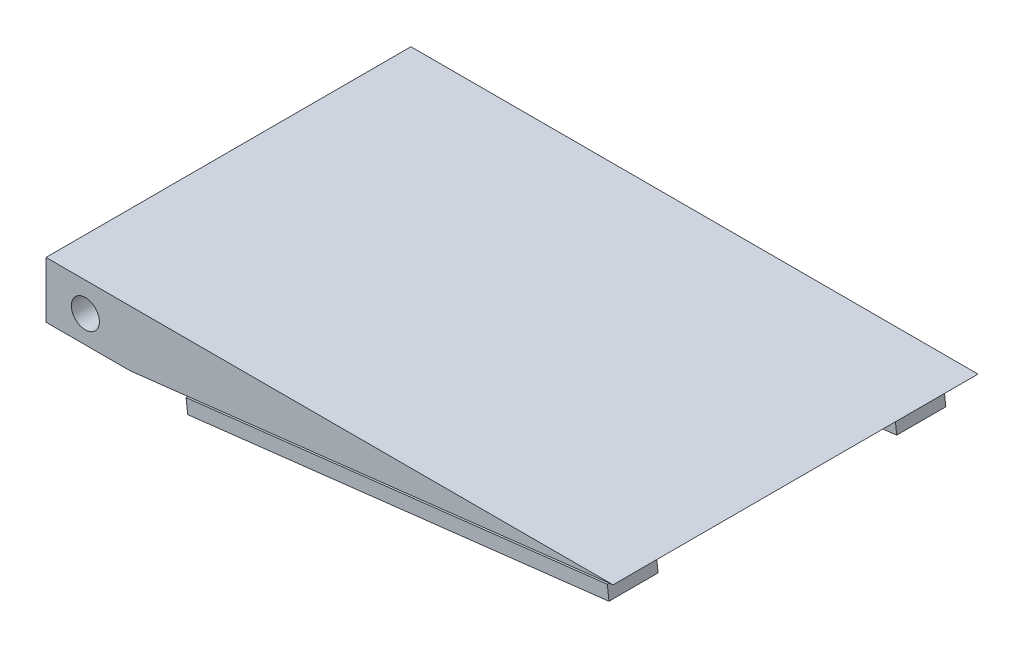
ISO-10303-21;
HEADER;
FILE_DESCRIPTION(('STEP AP214'),'2;1');
FILE_NAME('part.step','',(''),(''),'','','');
FILE_SCHEMA(('AUTOMOTIVE_DESIGN { 1 0 10303 214 1 1 1 1 }'));
ENDSEC;
DATA;
#1=APPLICATION_CONTEXT('core data for automotive mechanical design processes');
#2=APPLICATION_PROTOCOL_DEFINITION('international standard','automotive_design',2000,#1);
#3=PRODUCT_CONTEXT('',#1,'mechanical');
#4=PRODUCT('Part','Part','',(#3));
#5=PRODUCT_RELATED_PRODUCT_CATEGORY('part','',(#4));
#6=PRODUCT_DEFINITION_FORMATION('','',#4);
#7=PRODUCT_DEFINITION_CONTEXT('part definition',#1,'design');
#8=PRODUCT_DEFINITION('design','',#6,#7);
#9=PRODUCT_DEFINITION_SHAPE('','',#8);
#10=(LENGTH_UNIT() NAMED_UNIT(*) SI_UNIT(.MILLI.,.METRE.));
#11=(NAMED_UNIT(*) PLANE_ANGLE_UNIT() SI_UNIT($,.RADIAN.));
#12=(NAMED_UNIT(*) SI_UNIT($,.STERADIAN.) SOLID_ANGLE_UNIT());
#13=UNCERTAINTY_MEASURE_WITH_UNIT(LENGTH_MEASURE(1.E-05),#10,'distance_accuracy_value','');
#14=(GEOMETRIC_REPRESENTATION_CONTEXT(3) GLOBAL_UNCERTAINTY_ASSIGNED_CONTEXT((#13)) GLOBAL_UNIT_ASSIGNED_CONTEXT((#10,
#11,#12)) REPRESENTATION_CONTEXT('',''));
#15=CARTESIAN_POINT('',(0.,0.,0.));
#16=DIRECTION('',(0.,0.,1.));
#17=DIRECTION('',(1.,0.,0.));
#18=AXIS2_PLACEMENT_3D('',#15,#16,#17);
#19=CARTESIAN_POINT('',(-151.627963525836,0.,-166.60547112462));
#20=DIRECTION('',(-0.115500858174564,0.993307380301254,0.));
#21=DIRECTION('',(-0.993307380301254,-0.115500858174564,0.));
#22=AXIS2_PLACEMENT_3D('',#19,#20,#21);
#23=PLANE('',#22);
#24=DIRECTION('',(-0.993307380301254,-0.115500858174564,0.));
#25=VECTOR('',#24,1.);
#26=CARTESIAN_POINT('',(-115.250459170076,4.22994236694888,119.14452887538));
#27=LINE('',#26,#25);
#28=CARTESIAN_POINT('',(265.153546849035,48.4629663226594,119.14452887538));
#29=VERTEX_POINT('',#28);
#30=CARTESIAN_POINT('',(-115.250459170076,4.22994236694888,119.14452887538));
#31=VERTEX_POINT('',#30);
#32=EDGE_CURVE('E236',#29,#31,#27,.T.);
#33=ORIENTED_EDGE('',*,*,#32,.T.);
#34=DIRECTION('',(0.,0.,1.));
#35=VECTOR('',#34,1.);
#36=CARTESIAN_POINT('',(-115.250459170076,4.22994236694888,119.14452887538));
#37=LINE('',#36,#35);
#38=CARTESIAN_POINT('',(-115.250459170076,4.22994236694888,138.19452887538));
#39=VERTEX_POINT('',#38);
#40=EDGE_CURVE('E190',#31,#39,#37,.T.);
#41=ORIENTED_EDGE('',*,*,#40,.T.);
#42=DIRECTION('',(0.993307380301254,0.115500858174564,0.));
#43=VECTOR('',#42,1.);
#44=CARTESIAN_POINT('',(-115.250459170076,4.22994236694888,138.19452887538));
#45=LINE('',#44,#43);
#46=CARTESIAN_POINT('',(265.153546849035,48.4629663226594,138.19452887538));
#47=VERTEX_POINT('',#46);
#48=EDGE_CURVE('E227',#39,#47,#45,.T.);
#49=ORIENTED_EDGE('',*,*,#48,.T.);
#50=DIRECTION('',(0.,0.,-1.));
#51=VECTOR('',#50,1.);
#52=CARTESIAN_POINT('',(265.153546849035,48.4629663226594,119.14452887538));
#53=LINE('',#52,#51);
#54=EDGE_CURVE('E54',#47,#29,#53,.T.);
#55=ORIENTED_EDGE('',*,*,#54,.T.);
#56=EDGE_LOOP('',(#33,#41,#49,#55));
#57=FACE_BOUND('',#56,.T.);
#58=DIRECTION('',(-0.993307380301254,-0.115500858174564,0.));
#59=VECTOR('',#58,1.);
#60=CARTESIAN_POINT('',(-151.627963525836,0.,163.59452887538));
#61=LINE('',#60,#59);
#62=CARTESIAN_POINT('',(285.252036474164,50.8,163.59452887538));
#63=VERTEX_POINT('',#62);
#64=CARTESIAN_POINT('',(-151.627963525836,0.,163.59452887538));
#65=VERTEX_POINT('',#64);
#66=EDGE_CURVE('E315',#63,#65,#61,.T.);
#67=ORIENTED_EDGE('',*,*,#66,.T.);
#68=DIRECTION('',(0.,0.,1.));
#69=VECTOR('',#68,1.);
#70=CARTESIAN_POINT('',(-151.627963525836,0.,-166.60547112462));
#71=LINE('',#70,#69);
#72=CARTESIAN_POINT('',(-151.627963525836,0.,-166.60547112462));
#73=VERTEX_POINT('',#72);
#74=EDGE_CURVE('E314',#73,#65,#71,.T.);
#75=ORIENTED_EDGE('',*,*,#74,.F.);
#76=DIRECTION('',(-0.993307380301254,-0.115500858174564,0.));
#77=VECTOR('',#76,1.);
#78=CARTESIAN_POINT('',(-151.627963525836,0.,-166.60547112462));
#79=LINE('',#78,#77);
#80=CARTESIAN_POINT('',(285.252036474164,50.8,-166.60547112462));
#81=VERTEX_POINT('',#80);
#82=EDGE_CURVE('E311',#81,#73,#79,.T.);
#83=ORIENTED_EDGE('',*,*,#82,.F.);
#84=DIRECTION('',(0.,0.,-1.));
#85=VECTOR('',#84,1.);
#86=CARTESIAN_POINT('',(285.252036474164,50.8,-166.60547112462));
#87=LINE('',#86,#85);
#88=EDGE_CURVE('E332',#63,#81,#87,.T.);
#89=ORIENTED_EDGE('',*,*,#88,.F.);
#90=EDGE_LOOP('',(#67,#75,#83,#89));
#91=FACE_BOUND('',#90,.T.);
#92=DIRECTION('',(0.,0.,-1.));
#93=VECTOR('',#92,1.);
#94=CARTESIAN_POINT('',(-115.250459170076,4.22994236694888,-122.15547112462));
#95=LINE('',#94,#93);
#96=CARTESIAN_POINT('',(-115.250459170076,4.22994236694888,-122.15547112462));
#97=VERTEX_POINT('',#96);
#98=CARTESIAN_POINT('',(-115.250459170076,4.22994236694888,-141.20547112462));
#99=VERTEX_POINT('',#98);
#100=EDGE_CURVE('E280',#97,#99,#95,.T.);
#101=ORIENTED_EDGE('',*,*,#100,.F.);
#102=DIRECTION('',(-0.993307380301254,-0.115500858174564,0.));
#103=VECTOR('',#102,1.);
#104=CARTESIAN_POINT('',(-115.250459170076,4.22994236694888,-122.15547112462));
#105=LINE('',#104,#103);
#106=CARTESIAN_POINT('',(265.153546849035,48.4629663226594,-122.15547112462));
#107=VERTEX_POINT('',#106);
#108=EDGE_CURVE('E285',#107,#97,#105,.T.);
#109=ORIENTED_EDGE('',*,*,#108,.F.);
#110=DIRECTION('',(0.,0.,1.));
#111=VECTOR('',#110,1.);
#112=CARTESIAN_POINT('',(265.153546849035,48.4629663226594,-122.15547112462));
#113=LINE('',#112,#111);
#114=CARTESIAN_POINT('',(265.153546849035,48.4629663226594,-141.20547112462));
#115=VERTEX_POINT('',#114);
#116=EDGE_CURVE('E295',#115,#107,#113,.T.);
#117=ORIENTED_EDGE('',*,*,#116,.F.);
#118=DIRECTION('',(0.993307380301254,0.115500858174564,0.));
#119=VECTOR('',#118,1.);
#120=CARTESIAN_POINT('',(-115.250459170076,4.22994236694888,-141.20547112462));
#121=LINE('',#120,#119);
#122=EDGE_CURVE('E62',#99,#115,#121,.T.);
#123=ORIENTED_EDGE('',*,*,#122,.F.);
#124=EDGE_LOOP('',(#101,#109,#117,#123));
#125=FACE_BOUND('',#124,.T.);
#126=ADVANCED_FACE('F39',(#57,#91,#125),#23,.F.);
#127=CARTESIAN_POINT('',(-227.827963525836,50.8,-166.60547112462));
#128=DIRECTION('',(1.,0.,0.));
#129=DIRECTION('',(0.,0.,-1.));
#130=AXIS2_PLACEMENT_3D('',#127,#128,#129);
#131=PLANE('',#130);
#132=DIRECTION('',(0.,0.,1.));
#133=VECTOR('',#132,1.);
#134=CARTESIAN_POINT('',(-227.827963525836,0.,-166.60547112462));
#135=LINE('',#134,#133);
#136=CARTESIAN_POINT('',(-227.827963525836,0.,-166.60547112462));
#137=VERTEX_POINT('',#136);
#138=CARTESIAN_POINT('',(-227.827963525836,0.,163.59452887538));
#139=VERTEX_POINT('',#138);
#140=EDGE_CURVE('E320',#137,#139,#135,.T.);
#141=ORIENTED_EDGE('',*,*,#140,.T.);
#142=DIRECTION('',(0.,-1.,0.));
#143=VECTOR('',#142,1.);
#144=CARTESIAN_POINT('',(-227.827963525836,50.8,163.59452887538));
#145=LINE('',#144,#143);
#146=CARTESIAN_POINT('',(-227.827963525836,50.8,163.59452887538));
#147=VERTEX_POINT('',#146);
#148=EDGE_CURVE('E11',#147,#139,#145,.T.);
#149=ORIENTED_EDGE('',*,*,#148,.F.);
#150=DIRECTION('',(0.,0.,1.));
#151=VECTOR('',#150,1.);
#152=CARTESIAN_POINT('',(-227.827963525836,50.8,-166.60547112462));
#153=LINE('',#152,#151);
#154=CARTESIAN_POINT('',(-227.827963525836,50.8,-166.60547112462));
#155=VERTEX_POINT('',#154);
#156=EDGE_CURVE('E325',#155,#147,#153,.T.);
#157=ORIENTED_EDGE('',*,*,#156,.F.);
#158=DIRECTION('',(0.,-1.,0.));
#159=VECTOR('',#158,1.);
#160=CARTESIAN_POINT('',(-227.827963525836,50.8,-166.60547112462));
#161=LINE('',#160,#159);
#162=EDGE_CURVE('E47',#155,#137,#161,.T.);
#163=ORIENTED_EDGE('',*,*,#162,.T.);
#164=EDGE_LOOP('',(#141,#149,#157,#163));
#165=FACE_BOUND('',#164,.T.);
#166=ADVANCED_FACE('F41',(#165),#131,.F.);
#167=CARTESIAN_POINT('',(-227.827963525836,50.8,163.59452887538));
#168=DIRECTION('',(0.,0.,-1.));
#169=DIRECTION('',(-1.,0.,0.));
#170=AXIS2_PLACEMENT_3D('',#167,#168,#169);
#171=PLANE('',#170);
#172=CARTESIAN_POINT('',(-192.209486061846,24.513920690372,163.59452887538));
#173=DIRECTION('',(0.,0.,1.));
#174=DIRECTION('',(1.,0.,0.));
#175=AXIS2_PLACEMENT_3D('',#172,#173,#174);
#176=CIRCLE('',#175,12.7);
#177=CARTESIAN_POINT('',(-179.509486061846,24.513920690372,163.59452887538));
#178=VERTEX_POINT('',#177);
#179=EDGE_CURVE('E317',#178,#178,#176,.T.);
#180=ORIENTED_EDGE('',*,*,#179,.F.);
#181=EDGE_LOOP('',(#180));
#182=FACE_BOUND('',#181,.T.);
#183=DIRECTION('',(1.,0.,0.));
#184=VECTOR('',#183,1.);
#185=CARTESIAN_POINT('',(-227.827963525836,0.,163.59452887538));
#186=LINE('',#185,#184);
#187=EDGE_CURVE('E339',#139,#65,#186,.T.);
#188=ORIENTED_EDGE('',*,*,#187,.T.);
#189=ORIENTED_EDGE('',*,*,#66,.F.);
#190=DIRECTION('',(1.,0.,0.));
#191=VECTOR('',#190,1.);
#192=CARTESIAN_POINT('',(-227.827963525836,50.8,163.59452887538));
#193=LINE('',#192,#191);
#194=EDGE_CURVE('E328',#147,#63,#193,.T.);
#195=ORIENTED_EDGE('',*,*,#194,.F.);
#196=ORIENTED_EDGE('',*,*,#148,.T.);
#197=EDGE_LOOP('',(#188,#189,#195,#196));
#198=FACE_BOUND('',#197,.T.);
#199=ADVANCED_FACE('F355',(#182,#198),#171,.F.);
#200=CARTESIAN_POINT('',(-227.827963525836,50.8,-166.60547112462));
#201=DIRECTION('',(0.,0.,1.));
#202=DIRECTION('',(1.,0.,0.));
#203=AXIS2_PLACEMENT_3D('',#200,#201,#202);
#204=PLANE('',#203);
#205=CARTESIAN_POINT('',(-192.209486061846,24.513920690372,-166.60547112462));
#206=DIRECTION('',(0.,0.,1.));
#207=DIRECTION('',(1.,0.,0.));
#208=AXIS2_PLACEMENT_3D('',#205,#206,#207);
#209=CIRCLE('',#208,12.7);
#210=CARTESIAN_POINT('',(-179.509486061846,24.513920690372,-166.60547112462));
#211=VERTEX_POINT('',#210);
#212=EDGE_CURVE('E310',#211,#211,#209,.T.);
#213=ORIENTED_EDGE('',*,*,#212,.T.);
#214=EDGE_LOOP('',(#213));
#215=FACE_BOUND('',#214,.T.);
#216=DIRECTION('',(-1.,0.,0.));
#217=VECTOR('',#216,1.);
#218=CARTESIAN_POINT('',(-227.827963525836,50.8,-166.60547112462));
#219=LINE('',#218,#217);
#220=EDGE_CURVE('E335',#81,#155,#219,.T.);
#221=ORIENTED_EDGE('',*,*,#220,.F.);
#222=ORIENTED_EDGE('',*,*,#82,.T.);
#223=DIRECTION('',(-1.,0.,0.));
#224=VECTOR('',#223,1.);
#225=CARTESIAN_POINT('',(-227.827963525836,0.,-166.60547112462));
#226=LINE('',#225,#224);
#227=EDGE_CURVE('E329',#73,#137,#226,.T.);
#228=ORIENTED_EDGE('',*,*,#227,.T.);
#229=ORIENTED_EDGE('',*,*,#162,.F.);
#230=EDGE_LOOP('',(#221,#222,#228,#229));
#231=FACE_BOUND('',#230,.T.);
#232=ADVANCED_FACE('F358',(#215,#231),#204,.F.);
#233=CARTESIAN_POINT('',(0.,50.8,0.));
#234=DIRECTION('',(0.,1.,0.));
#235=DIRECTION('',(0.,0.,1.));
#236=AXIS2_PLACEMENT_3D('',#233,#234,#235);
#237=PLANE('',#236);
#238=ORIENTED_EDGE('',*,*,#156,.T.);
#239=ORIENTED_EDGE('',*,*,#194,.T.);
#240=ORIENTED_EDGE('',*,*,#88,.T.);
#241=ORIENTED_EDGE('',*,*,#220,.T.);
#242=EDGE_LOOP('',(#238,#239,#240,#241));
#243=FACE_BOUND('',#242,.T.);
#244=ADVANCED_FACE('F357',(#243),#237,.T.);
#245=CARTESIAN_POINT('',(0.,0.,0.));
#246=DIRECTION('',(0.,1.,0.));
#247=DIRECTION('',(0.,0.,1.));
#248=AXIS2_PLACEMENT_3D('',#245,#246,#247);
#249=PLANE('',#248);
#250=ORIENTED_EDGE('',*,*,#227,.F.);
#251=ORIENTED_EDGE('',*,*,#74,.T.);
#252=ORIENTED_EDGE('',*,*,#187,.F.);
#253=ORIENTED_EDGE('',*,*,#140,.F.);
#254=EDGE_LOOP('',(#250,#251,#252,#253));
#255=FACE_BOUND('',#254,.T.);
#256=ADVANCED_FACE('F352',(#255),#249,.F.);
#257=CARTESIAN_POINT('',(-192.209486061846,24.513920690372,-166.60547112462));
#258=DIRECTION('',(0.,0.,1.));
#259=DIRECTION('',(1.,0.,0.));
#260=AXIS2_PLACEMENT_3D('',#257,#258,#259);
#261=CYLINDRICAL_SURFACE('',#260,12.7);
#262=ORIENTED_EDGE('',*,*,#212,.F.);
#263=EDGE_LOOP('',(#262));
#264=FACE_BOUND('',#263,.T.);
#265=ORIENTED_EDGE('',*,*,#179,.T.);
#266=EDGE_LOOP('',(#265));
#267=FACE_BOUND('',#266,.T.);
#268=ADVANCED_FACE('F413',(#264,#267),#261,.F.);
#269=CARTESIAN_POINT('',(-113.783598271259,-8.38506136287704,-122.15547112462));
#270=DIRECTION('',(0.993307380301254,0.115500858174564,0.));
#271=DIRECTION('',(-0.115500858174564,0.993307380301254,0.));
#272=AXIS2_PLACEMENT_3D('',#269,#270,#271);
#273=PLANE('',#272);
#274=ORIENTED_EDGE('',*,*,#100,.T.);
#275=DIRECTION('',(-0.115500858174564,0.993307380301254,0.));
#276=VECTOR('',#275,1.);
#277=CARTESIAN_POINT('',(-113.783598271259,-8.38506136287704,-141.20547112462));
#278=LINE('',#277,#276);
#279=CARTESIAN_POINT('',(-113.783598271259,-8.38506136287703,-141.20547112462));
#280=VERTEX_POINT('',#279);
#281=EDGE_CURVE('E308',#280,#99,#278,.T.);
#282=ORIENTED_EDGE('',*,*,#281,.F.);
#283=DIRECTION('',(0.,0.,-1.));
#284=VECTOR('',#283,1.);
#285=CARTESIAN_POINT('',(-113.783598271259,-8.38506136287703,-109.45547112462));
#286=LINE('',#285,#284);
#287=CARTESIAN_POINT('',(-113.783598271259,-8.38506136287703,-153.90547112462));
#288=VERTEX_POINT('',#287);
#289=EDGE_CURVE('E249',#280,#288,#286,.T.);
#290=ORIENTED_EDGE('',*,*,#289,.T.);
#291=DIRECTION('',(-0.115500858174564,0.993307380301254,0.));
#292=VECTOR('',#291,1.);
#293=CARTESIAN_POINT('',(-112.316737372442,-21.000065092703,-153.90547112462));
#294=LINE('',#293,#292);
#295=CARTESIAN_POINT('',(-112.316737372442,-21.000065092703,-153.90547112462));
#296=VERTEX_POINT('',#295);
#297=EDGE_CURVE('E277',#296,#288,#294,.T.);
#298=ORIENTED_EDGE('',*,*,#297,.F.);
#299=DIRECTION('',(0.,0.,-1.));
#300=VECTOR('',#299,1.);
#301=CARTESIAN_POINT('',(-112.316737372442,-21.000065092703,-109.45547112462));
#302=LINE('',#301,#300);
#303=CARTESIAN_POINT('',(-112.316737372442,-21.000065092703,-109.45547112462));
#304=VERTEX_POINT('',#303);
#305=EDGE_CURVE('E250',#304,#296,#302,.T.);
#306=ORIENTED_EDGE('',*,*,#305,.F.);
#307=DIRECTION('',(-0.115500858174564,0.993307380301254,0.));
#308=VECTOR('',#307,1.);
#309=CARTESIAN_POINT('',(-112.316737372442,-21.000065092703,-109.45547112462));
#310=LINE('',#309,#308);
#311=CARTESIAN_POINT('',(-113.783598271259,-8.38506136287703,-109.45547112462));
#312=VERTEX_POINT('',#311);
#313=EDGE_CURVE('E260',#304,#312,#310,.T.);
#314=ORIENTED_EDGE('',*,*,#313,.T.);
#315=CARTESIAN_POINT('',(-113.783598271259,-8.38506136287704,-122.15547112462));
#316=VERTEX_POINT('',#315);
#317=EDGE_CURVE('E261',#312,#316,#286,.T.);
#318=ORIENTED_EDGE('',*,*,#317,.T.);
#319=DIRECTION('',(-0.115500858174564,0.993307380301254,0.));
#320=VECTOR('',#319,1.);
#321=CARTESIAN_POINT('',(-113.783598271259,-8.38506136287704,-122.15547112462));
#322=LINE('',#321,#320);
#323=EDGE_CURVE('E291',#316,#97,#322,.T.);
#324=ORIENTED_EDGE('',*,*,#323,.T.);
#325=EDGE_LOOP('',(#274,#282,#290,#298,#306,#314,#318,#324));
#326=FACE_BOUND('',#325,.T.);
#327=ADVANCED_FACE('F367',(#326),#273,.F.);
#328=CARTESIAN_POINT('',(-113.783598271259,-8.38506136287704,-141.20547112462));
#329=DIRECTION('',(0.,0.,1.));
#330=DIRECTION('',(1.,0.,0.));
#331=AXIS2_PLACEMENT_3D('',#328,#329,#330);
#332=PLANE('',#331);
#333=ORIENTED_EDGE('',*,*,#122,.T.);
#334=DIRECTION('',(-0.115500858174564,0.993307380301254,0.));
#335=VECTOR('',#334,1.);
#336=CARTESIAN_POINT('',(266.620407747852,35.8479625928335,-141.20547112462));
#337=LINE('',#336,#335);
#338=CARTESIAN_POINT('',(266.620407747852,35.8479625928335,-141.20547112462));
#339=VERTEX_POINT('',#338);
#340=EDGE_CURVE('E305',#339,#115,#337,.T.);
#341=ORIENTED_EDGE('',*,*,#340,.F.);
#342=DIRECTION('',(0.993307380301254,0.115500858174564,0.));
#343=VECTOR('',#342,1.);
#344=CARTESIAN_POINT('',(-113.783598271259,-8.38506136287704,-141.20547112462));
#345=LINE('',#344,#343);
#346=EDGE_CURVE('E281',#280,#339,#345,.T.);
#347=ORIENTED_EDGE('',*,*,#346,.F.);
#348=ORIENTED_EDGE('',*,*,#281,.T.);
#349=EDGE_LOOP('',(#333,#341,#347,#348));
#350=FACE_BOUND('',#349,.T.);
#351=ADVANCED_FACE('F381',(#350),#332,.F.);
#352=CARTESIAN_POINT('',(266.620407747852,35.8479625928335,-122.15547112462));
#353=DIRECTION('',(-0.993307380301254,-0.115500858174564,0.));
#354=DIRECTION('',(0.115500858174564,-0.993307380301254,0.));
#355=AXIS2_PLACEMENT_3D('',#352,#353,#354);
#356=PLANE('',#355);
#357=ORIENTED_EDGE('',*,*,#116,.T.);
#358=DIRECTION('',(-0.115500858174564,0.993307380301254,0.));
#359=VECTOR('',#358,1.);
#360=CARTESIAN_POINT('',(266.620407747852,35.8479625928335,-122.15547112462));
#361=LINE('',#360,#359);
#362=CARTESIAN_POINT('',(266.620407747852,35.8479625928335,-122.15547112462));
#363=VERTEX_POINT('',#362);
#364=EDGE_CURVE('E302',#363,#107,#361,.T.);
#365=ORIENTED_EDGE('',*,*,#364,.F.);
#366=DIRECTION('',(0.,0.,1.));
#367=VECTOR('',#366,1.);
#368=CARTESIAN_POINT('',(266.620407747852,35.8479625928335,-122.15547112462));
#369=LINE('',#368,#367);
#370=EDGE_CURVE('E284',#339,#363,#369,.T.);
#371=ORIENTED_EDGE('',*,*,#370,.F.);
#372=ORIENTED_EDGE('',*,*,#340,.T.);
#373=EDGE_LOOP('',(#357,#365,#371,#372));
#374=FACE_BOUND('',#373,.T.);
#375=ADVANCED_FACE('F379',(#374),#356,.F.);
#376=CARTESIAN_POINT('',(-113.783598271259,-8.38506136287704,-122.15547112462));
#377=DIRECTION('',(0.,0.,-1.));
#378=DIRECTION('',(-1.,0.,0.));
#379=AXIS2_PLACEMENT_3D('',#376,#377,#378);
#380=PLANE('',#379);
#381=ORIENTED_EDGE('',*,*,#108,.T.);
#382=ORIENTED_EDGE('',*,*,#323,.F.);
#383=DIRECTION('',(-0.993307380301254,-0.115500858174564,0.));
#384=VECTOR('',#383,1.);
#385=CARTESIAN_POINT('',(-113.783598271259,-8.38506136287704,-122.15547112462));
#386=LINE('',#385,#384);
#387=EDGE_CURVE('E288',#363,#316,#386,.T.);
#388=ORIENTED_EDGE('',*,*,#387,.F.);
#389=ORIENTED_EDGE('',*,*,#364,.T.);
#390=EDGE_LOOP('',(#381,#382,#388,#389));
#391=FACE_BOUND('',#390,.T.);
#392=ADVANCED_FACE('F365',(#391),#380,.F.);
#393=CARTESIAN_POINT('',(-0.555924100193652,4.7809472616654,0.));
#394=DIRECTION('',(0.115500858174564,-0.993307380301254,0.));
#395=DIRECTION('',(0.993307380301254,0.115500858174564,0.));
#396=AXIS2_PLACEMENT_3D('',#393,#394,#395);
#397=PLANE('',#396);
#398=ORIENTED_EDGE('',*,*,#289,.F.);
#399=ORIENTED_EDGE('',*,*,#346,.T.);
#400=ORIENTED_EDGE('',*,*,#370,.T.);
#401=ORIENTED_EDGE('',*,*,#387,.T.);
#402=ORIENTED_EDGE('',*,*,#317,.F.);
#403=DIRECTION('',(-0.993307380301254,-0.115500858174564,0.));
#404=VECTOR('',#403,1.);
#405=CARTESIAN_POINT('',(-113.783598271259,-8.38506136287703,-109.45547112462));
#406=LINE('',#405,#404);
#407=CARTESIAN_POINT('',(267.370318197885,35.9351614823723,-109.45547112462));
#408=VERTEX_POINT('',#407);
#409=EDGE_CURVE('E254',#408,#312,#406,.T.);
#410=ORIENTED_EDGE('',*,*,#409,.F.);
#411=DIRECTION('',(0.,0.,1.));
#412=VECTOR('',#411,1.);
#413=CARTESIAN_POINT('',(267.370318197885,35.9351614823723,-109.45547112462));
#414=LINE('',#413,#412);
#415=CARTESIAN_POINT('',(267.370318197885,35.9351614823723,-153.90547112462));
#416=VERTEX_POINT('',#415);
#417=EDGE_CURVE('E266',#416,#408,#414,.T.);
#418=ORIENTED_EDGE('',*,*,#417,.F.);
#419=DIRECTION('',(0.993307380301254,0.115500858174564,0.));
#420=VECTOR('',#419,1.);
#421=CARTESIAN_POINT('',(-113.783598271259,-8.38506136287703,-153.90547112462));
#422=LINE('',#421,#420);
#423=EDGE_CURVE('E264',#288,#416,#422,.T.);
#424=ORIENTED_EDGE('',*,*,#423,.F.);
#425=EDGE_LOOP('',(#398,#399,#400,#401,#402,#410,#418,#424));
#426=FACE_BOUND('',#425,.T.);
#427=ADVANCED_FACE('F374',(#426),#397,.F.);
#428=CARTESIAN_POINT('',(-112.316737372442,-21.000065092703,-153.90547112462));
#429=DIRECTION('',(0.,0.,1.));
#430=DIRECTION('',(1.,0.,0.));
#431=AXIS2_PLACEMENT_3D('',#428,#429,#430);
#432=PLANE('',#431);
#433=ORIENTED_EDGE('',*,*,#423,.T.);
#434=DIRECTION('',(-0.115500858174564,0.993307380301254,0.));
#435=VECTOR('',#434,1.);
#436=CARTESIAN_POINT('',(268.837179096702,23.3201577525464,-153.90547112462));
#437=LINE('',#436,#435);
#438=CARTESIAN_POINT('',(268.837179096702,23.3201577525464,-153.90547112462));
#439=VERTEX_POINT('',#438);
#440=EDGE_CURVE('E274',#439,#416,#437,.T.);
#441=ORIENTED_EDGE('',*,*,#440,.F.);
#442=DIRECTION('',(0.993307380301254,0.115500858174564,0.));
#443=VECTOR('',#442,1.);
#444=CARTESIAN_POINT('',(-112.316737372442,-21.000065092703,-153.90547112462));
#445=LINE('',#444,#443);
#446=EDGE_CURVE('E253',#296,#439,#445,.T.);
#447=ORIENTED_EDGE('',*,*,#446,.F.);
#448=ORIENTED_EDGE('',*,*,#297,.T.);
#449=EDGE_LOOP('',(#433,#441,#447,#448));
#450=FACE_BOUND('',#449,.T.);
#451=ADVANCED_FACE('F386',(#450),#432,.F.);
#452=CARTESIAN_POINT('',(268.837179096702,23.3201577525464,-109.45547112462));
#453=DIRECTION('',(-0.993307380301254,-0.115500858174564,0.));
#454=DIRECTION('',(0.115500858174564,-0.993307380301254,0.));
#455=AXIS2_PLACEMENT_3D('',#452,#453,#454);
#456=PLANE('',#455);
#457=ORIENTED_EDGE('',*,*,#417,.T.);
#458=DIRECTION('',(-0.115500858174564,0.993307380301254,0.));
#459=VECTOR('',#458,1.);
#460=CARTESIAN_POINT('',(268.837179096702,23.3201577525464,-109.45547112462));
#461=LINE('',#460,#459);
#462=CARTESIAN_POINT('',(268.837179096702,23.3201577525464,-109.45547112462));
#463=VERTEX_POINT('',#462);
#464=EDGE_CURVE('E271',#463,#408,#461,.T.);
#465=ORIENTED_EDGE('',*,*,#464,.F.);
#466=DIRECTION('',(0.,0.,1.));
#467=VECTOR('',#466,1.);
#468=CARTESIAN_POINT('',(268.837179096702,23.3201577525464,-109.45547112462));
#469=LINE('',#468,#467);
#470=EDGE_CURVE('E256',#439,#463,#469,.T.);
#471=ORIENTED_EDGE('',*,*,#470,.F.);
#472=ORIENTED_EDGE('',*,*,#440,.T.);
#473=EDGE_LOOP('',(#457,#465,#471,#472));
#474=FACE_BOUND('',#473,.T.);
#475=ADVANCED_FACE('F395',(#474),#456,.F.);
#476=CARTESIAN_POINT('',(-112.316737372442,-21.000065092703,-109.45547112462));
#477=DIRECTION('',(0.,0.,-1.));
#478=DIRECTION('',(-1.,0.,0.));
#479=AXIS2_PLACEMENT_3D('',#476,#477,#478);
#480=PLANE('',#479);
#481=ORIENTED_EDGE('',*,*,#409,.T.);
#482=ORIENTED_EDGE('',*,*,#313,.F.);
#483=DIRECTION('',(-0.993307380301254,-0.115500858174564,0.));
#484=VECTOR('',#483,1.);
#485=CARTESIAN_POINT('',(-112.316737372442,-21.000065092703,-109.45547112462));
#486=LINE('',#485,#484);
#487=EDGE_CURVE('E258',#463,#304,#486,.T.);
#488=ORIENTED_EDGE('',*,*,#487,.F.);
#489=ORIENTED_EDGE('',*,*,#464,.T.);
#490=EDGE_LOOP('',(#481,#482,#488,#489));
#491=FACE_BOUND('',#490,.T.);
#492=ADVANCED_FACE('F393',(#491),#480,.F.);
#493=CARTESIAN_POINT('',(0.910936798623316,-7.83405646816052,0.));
#494=DIRECTION('',(0.115500858174564,-0.993307380301254,0.));
#495=DIRECTION('',(0.993307380301254,0.115500858174564,0.));
#496=AXIS2_PLACEMENT_3D('',#493,#494,#495);
#497=PLANE('',#496);
#498=ORIENTED_EDGE('',*,*,#305,.T.);
#499=ORIENTED_EDGE('',*,*,#446,.T.);
#500=ORIENTED_EDGE('',*,*,#470,.T.);
#501=ORIENTED_EDGE('',*,*,#487,.T.);
#502=EDGE_LOOP('',(#498,#499,#500,#501));
#503=FACE_BOUND('',#502,.T.);
#504=ADVANCED_FACE('F389',(#503),#497,.T.);
#505=CARTESIAN_POINT('',(-113.783598271259,-8.38506136287704,119.14452887538));
#506=DIRECTION('',(-0.993307380301254,-0.115500858174564,0.));
#507=DIRECTION('',(0.115500858174564,-0.993307380301254,0.));
#508=AXIS2_PLACEMENT_3D('',#505,#506,#507);
#509=PLANE('',#508);
#510=ORIENTED_EDGE('',*,*,#40,.F.);
#511=DIRECTION('',(-0.115500858174564,0.993307380301254,0.));
#512=VECTOR('',#511,1.);
#513=CARTESIAN_POINT('',(-113.783598271259,-8.38506136287704,119.14452887538));
#514=LINE('',#513,#512);
#515=CARTESIAN_POINT('',(-113.783598271259,-8.38506136287703,119.14452887538));
#516=VERTEX_POINT('',#515);
#517=EDGE_CURVE('E247',#516,#31,#514,.T.);
#518=ORIENTED_EDGE('',*,*,#517,.F.);
#519=DIRECTION('',(0.,0.,1.));
#520=VECTOR('',#519,1.);
#521=CARTESIAN_POINT('',(-113.783598271259,-8.38506136287703,106.44452887538));
#522=LINE('',#521,#520);
#523=CARTESIAN_POINT('',(-113.783598271259,-8.38506136287703,106.44452887538));
#524=VERTEX_POINT('',#523);
#525=EDGE_CURVE('E185',#524,#516,#522,.T.);
#526=ORIENTED_EDGE('',*,*,#525,.F.);
#527=DIRECTION('',(-0.115500858174564,0.993307380301254,0.));
#528=VECTOR('',#527,1.);
#529=CARTESIAN_POINT('',(-112.316737372442,-21.000065092703,106.44452887538));
#530=LINE('',#529,#528);
#531=CARTESIAN_POINT('',(-112.316737372442,-21.000065092703,106.44452887538));
#532=VERTEX_POINT('',#531);
#533=EDGE_CURVE('E177',#532,#524,#530,.T.);
#534=ORIENTED_EDGE('',*,*,#533,.F.);
#535=DIRECTION('',(0.,0.,1.));
#536=VECTOR('',#535,1.);
#537=CARTESIAN_POINT('',(-112.316737372442,-21.000065092703,106.44452887538));
#538=LINE('',#537,#536);
#539=CARTESIAN_POINT('',(-112.316737372442,-21.000065092703,150.89452887538));
#540=VERTEX_POINT('',#539);
#541=EDGE_CURVE('E182',#532,#540,#538,.T.);
#542=ORIENTED_EDGE('',*,*,#541,.T.);
#543=DIRECTION('',(-0.115500858174564,0.993307380301254,0.));
#544=VECTOR('',#543,1.);
#545=CARTESIAN_POINT('',(-112.316737372442,-21.000065092703,150.89452887538));
#546=LINE('',#545,#544);
#547=CARTESIAN_POINT('',(-113.783598271259,-8.38506136287703,150.89452887538));
#548=VERTEX_POINT('',#547);
#549=EDGE_CURVE('E209',#540,#548,#546,.T.);
#550=ORIENTED_EDGE('',*,*,#549,.T.);
#551=CARTESIAN_POINT('',(-113.783598271259,-8.38506136287704,138.19452887538));
#552=VERTEX_POINT('',#551);
#553=EDGE_CURVE('E212',#552,#548,#522,.T.);
#554=ORIENTED_EDGE('',*,*,#553,.F.);
#555=DIRECTION('',(-0.115500858174564,0.993307380301254,0.));
#556=VECTOR('',#555,1.);
#557=CARTESIAN_POINT('',(-113.783598271259,-8.38506136287704,138.19452887538));
#558=LINE('',#557,#556);
#559=EDGE_CURVE('E233',#552,#39,#558,.T.);
#560=ORIENTED_EDGE('',*,*,#559,.T.);
#561=EDGE_LOOP('',(#510,#518,#526,#534,#542,#550,#554,#560));
#562=FACE_BOUND('',#561,.T.);
#563=ADVANCED_FACE('F180',(#562),#509,.T.);
#564=CARTESIAN_POINT('',(-113.783598271259,-8.38506136287704,119.14452887538));
#565=DIRECTION('',(0.,0.,-1.));
#566=DIRECTION('',(-1.,0.,0.));
#567=AXIS2_PLACEMENT_3D('',#564,#565,#566);
#568=PLANE('',#567);
#569=ORIENTED_EDGE('',*,*,#32,.F.);
#570=DIRECTION('',(-0.115500858174564,0.993307380301254,0.));
#571=VECTOR('',#570,1.);
#572=CARTESIAN_POINT('',(266.620407747852,35.8479625928335,119.14452887538));
#573=LINE('',#572,#571);
#574=CARTESIAN_POINT('',(266.620407747852,35.8479625928335,119.14452887538));
#575=VERTEX_POINT('',#574);
#576=EDGE_CURVE('E245',#575,#29,#573,.T.);
#577=ORIENTED_EDGE('',*,*,#576,.F.);
#578=DIRECTION('',(-0.993307380301254,-0.115500858174564,0.));
#579=VECTOR('',#578,1.);
#580=CARTESIAN_POINT('',(-113.783598271259,-8.38506136287704,119.14452887538));
#581=LINE('',#580,#579);
#582=EDGE_CURVE('E223',#575,#516,#581,.T.);
#583=ORIENTED_EDGE('',*,*,#582,.T.);
#584=ORIENTED_EDGE('',*,*,#517,.T.);
#585=EDGE_LOOP('',(#569,#577,#583,#584));
#586=FACE_BOUND('',#585,.T.);
#587=ADVANCED_FACE('F533',(#586),#568,.T.);
#588=CARTESIAN_POINT('',(266.620407747852,35.8479625928335,119.14452887538));
#589=DIRECTION('',(0.993307380301254,0.115500858174564,0.));
#590=DIRECTION('',(-0.115500858174564,0.993307380301254,0.));
#591=AXIS2_PLACEMENT_3D('',#588,#589,#590);
#592=PLANE('',#591);
#593=ORIENTED_EDGE('',*,*,#54,.F.);
#594=DIRECTION('',(-0.115500858174564,0.993307380301254,0.));
#595=VECTOR('',#594,1.);
#596=CARTESIAN_POINT('',(266.620407747852,35.8479625928335,138.19452887538));
#597=LINE('',#596,#595);
#598=CARTESIAN_POINT('',(266.620407747852,35.8479625928335,138.19452887538));
#599=VERTEX_POINT('',#598);
#600=EDGE_CURVE('E243',#599,#47,#597,.T.);
#601=ORIENTED_EDGE('',*,*,#600,.F.);
#602=DIRECTION('',(0.,0.,-1.));
#603=VECTOR('',#602,1.);
#604=CARTESIAN_POINT('',(266.620407747852,35.8479625928335,119.14452887538));
#605=LINE('',#604,#603);
#606=EDGE_CURVE('E226',#599,#575,#605,.T.);
#607=ORIENTED_EDGE('',*,*,#606,.T.);
#608=ORIENTED_EDGE('',*,*,#576,.T.);
#609=EDGE_LOOP('',(#593,#601,#607,#608));
#610=FACE_BOUND('',#609,.T.);
#611=ADVANCED_FACE('F545',(#610),#592,.T.);
#612=CARTESIAN_POINT('',(-113.783598271259,-8.38506136287704,138.19452887538));
#613=DIRECTION('',(0.,0.,1.));
#614=DIRECTION('',(1.,0.,0.));
#615=AXIS2_PLACEMENT_3D('',#612,#613,#614);
#616=PLANE('',#615);
#617=ORIENTED_EDGE('',*,*,#48,.F.);
#618=ORIENTED_EDGE('',*,*,#559,.F.);
#619=DIRECTION('',(0.993307380301254,0.115500858174564,0.));
#620=VECTOR('',#619,1.);
#621=CARTESIAN_POINT('',(-113.783598271259,-8.38506136287704,138.19452887538));
#622=LINE('',#621,#620);
#623=EDGE_CURVE('E230',#552,#599,#622,.T.);
#624=ORIENTED_EDGE('',*,*,#623,.T.);
#625=ORIENTED_EDGE('',*,*,#600,.T.);
#626=EDGE_LOOP('',(#617,#618,#624,#625));
#627=FACE_BOUND('',#626,.T.);
#628=ADVANCED_FACE('F554',(#627),#616,.T.);
#629=CARTESIAN_POINT('',(-112.316737372442,-21.000065092703,106.44452887538));
#630=DIRECTION('',(0.,0.,-1.));
#631=DIRECTION('',(-1.,0.,0.));
#632=AXIS2_PLACEMENT_3D('',#629,#630,#631);
#633=PLANE('',#632);
#634=DIRECTION('',(-0.993307380301254,-0.115500858174564,0.));
#635=VECTOR('',#634,1.);
#636=CARTESIAN_POINT('',(-113.783598271259,-8.38506136287703,106.44452887538));
#637=LINE('',#636,#635);
#638=CARTESIAN_POINT('',(267.370318197885,35.9351614823723,106.44452887538));
#639=VERTEX_POINT('',#638);
#640=EDGE_CURVE('E211',#639,#524,#637,.T.);
#641=ORIENTED_EDGE('',*,*,#640,.F.);
#642=DIRECTION('',(-0.115500858174564,0.993307380301254,0.));
#643=VECTOR('',#642,1.);
#644=CARTESIAN_POINT('',(268.837179096702,23.3201577525464,106.44452887538));
#645=LINE('',#644,#643);
#646=CARTESIAN_POINT('',(268.837179096702,23.3201577525464,106.44452887538));
#647=VERTEX_POINT('',#646);
#648=EDGE_CURVE('E191',#647,#639,#645,.T.);
#649=ORIENTED_EDGE('',*,*,#648,.F.);
#650=DIRECTION('',(-0.993307380301254,-0.115500858174564,0.));
#651=VECTOR('',#650,1.);
#652=CARTESIAN_POINT('',(-112.316737372442,-21.000065092703,106.44452887538));
#653=LINE('',#652,#651);
#654=EDGE_CURVE('E197',#647,#532,#653,.T.);
#655=ORIENTED_EDGE('',*,*,#654,.T.);
#656=ORIENTED_EDGE('',*,*,#533,.T.);
#657=EDGE_LOOP('',(#641,#649,#655,#656));
#658=FACE_BOUND('',#657,.T.);
#659=ADVANCED_FACE('F203',(#658),#633,.T.);
#660=CARTESIAN_POINT('',(268.837179096702,23.3201577525464,106.44452887538));
#661=DIRECTION('',(0.993307380301254,0.115500858174564,0.));
#662=DIRECTION('',(-0.115500858174564,0.993307380301254,0.));
#663=AXIS2_PLACEMENT_3D('',#660,#661,#662);
#664=PLANE('',#663);
#665=DIRECTION('',(0.,0.,-1.));
#666=VECTOR('',#665,1.);
#667=CARTESIAN_POINT('',(267.370318197885,35.9351614823723,106.44452887538));
#668=LINE('',#667,#666);
#669=CARTESIAN_POINT('',(267.370318197885,35.9351614823723,150.89452887538));
#670=VERTEX_POINT('',#669);
#671=EDGE_CURVE('E214',#670,#639,#668,.T.);
#672=ORIENTED_EDGE('',*,*,#671,.F.);
#673=DIRECTION('',(-0.115500858174564,0.993307380301254,0.));
#674=VECTOR('',#673,1.);
#675=CARTESIAN_POINT('',(268.837179096702,23.3201577525464,150.89452887538));
#676=LINE('',#675,#674);
#677=CARTESIAN_POINT('',(268.837179096702,23.3201577525464,150.89452887538));
#678=VERTEX_POINT('',#677);
#679=EDGE_CURVE('E220',#678,#670,#676,.T.);
#680=ORIENTED_EDGE('',*,*,#679,.F.);
#681=DIRECTION('',(0.,0.,-1.));
#682=VECTOR('',#681,1.);
#683=CARTESIAN_POINT('',(268.837179096702,23.3201577525464,106.44452887538));
#684=LINE('',#683,#682);
#685=EDGE_CURVE('E204',#678,#647,#684,.T.);
#686=ORIENTED_EDGE('',*,*,#685,.T.);
#687=ORIENTED_EDGE('',*,*,#648,.T.);
#688=EDGE_LOOP('',(#672,#680,#686,#687));
#689=FACE_BOUND('',#688,.T.);
#690=ADVANCED_FACE('F570',(#689),#664,.T.);
#691=CARTESIAN_POINT('',(-112.316737372442,-21.000065092703,150.89452887538));
#692=DIRECTION('',(0.,0.,1.));
#693=DIRECTION('',(1.,0.,0.));
#694=AXIS2_PLACEMENT_3D('',#691,#692,#693);
#695=PLANE('',#694);
#696=DIRECTION('',(0.993307380301254,0.115500858174564,0.));
#697=VECTOR('',#696,1.);
#698=CARTESIAN_POINT('',(-113.783598271259,-8.38506136287703,150.89452887538));
#699=LINE('',#698,#697);
#700=EDGE_CURVE('E201',#548,#670,#699,.T.);
#701=ORIENTED_EDGE('',*,*,#700,.F.);
#702=ORIENTED_EDGE('',*,*,#549,.F.);
#703=DIRECTION('',(0.993307380301254,0.115500858174564,0.));
#704=VECTOR('',#703,1.);
#705=CARTESIAN_POINT('',(-112.316737372442,-21.000065092703,150.89452887538));
#706=LINE('',#705,#704);
#707=EDGE_CURVE('E200',#540,#678,#706,.T.);
#708=ORIENTED_EDGE('',*,*,#707,.T.);
#709=ORIENTED_EDGE('',*,*,#679,.T.);
#710=EDGE_LOOP('',(#701,#702,#708,#709));
#711=FACE_BOUND('',#710,.T.);
#712=ADVANCED_FACE('F577',(#711),#695,.T.);
#713=CARTESIAN_POINT('',(0.910936798623316,-7.83405646816052,-3.0109422492402));
#714=DIRECTION('',(0.115500858174564,-0.993307380301254,0.));
#715=DIRECTION('',(0.993307380301254,0.115500858174564,0.));
#716=AXIS2_PLACEMENT_3D('',#713,#714,#715);
#717=PLANE('',#716);
#718=ORIENTED_EDGE('',*,*,#541,.F.);
#719=ORIENTED_EDGE('',*,*,#654,.F.);
#720=ORIENTED_EDGE('',*,*,#685,.F.);
#721=ORIENTED_EDGE('',*,*,#707,.F.);
#722=EDGE_LOOP('',(#718,#719,#720,#721));
#723=FACE_BOUND('',#722,.T.);
#724=ADVANCED_FACE('F195',(#723),#717,.T.);
#725=CARTESIAN_POINT('',(-0.555924100193652,4.7809472616654,-3.0109422492402));
#726=DIRECTION('',(0.115500858174564,-0.993307380301254,0.));
#727=DIRECTION('',(0.993307380301254,0.115500858174564,0.));
#728=AXIS2_PLACEMENT_3D('',#725,#726,#727);
#729=PLANE('',#728);
#730=ORIENTED_EDGE('',*,*,#582,.F.);
#731=ORIENTED_EDGE('',*,*,#606,.F.);
#732=ORIENTED_EDGE('',*,*,#623,.F.);
#733=ORIENTED_EDGE('',*,*,#553,.T.);
#734=ORIENTED_EDGE('',*,*,#700,.T.);
#735=ORIENTED_EDGE('',*,*,#671,.T.);
#736=ORIENTED_EDGE('',*,*,#640,.T.);
#737=ORIENTED_EDGE('',*,*,#525,.T.);
#738=EDGE_LOOP('',(#730,#731,#732,#733,#734,#735,#736,#737));
#739=FACE_BOUND('',#738,.T.);
#740=ADVANCED_FACE('F594',(#739),#729,.F.);
#741=CLOSED_SHELL('',(#126,#166,#199,#232,#244,#256,#268,#327,#351,#375,#392,#427,#451,#475,
#492,#504,#563,#587,#611,#628,#659,#690,#712,#724,#740));
#742=MANIFOLD_SOLID_BREP('B2',#741);
#743=ADVANCED_BREP_SHAPE_REPRESENTATION('',(#18,#742),#14);
#744=SHAPE_DEFINITION_REPRESENTATION(#9,#743);
ENDSEC;
END-ISO-10303-21;
